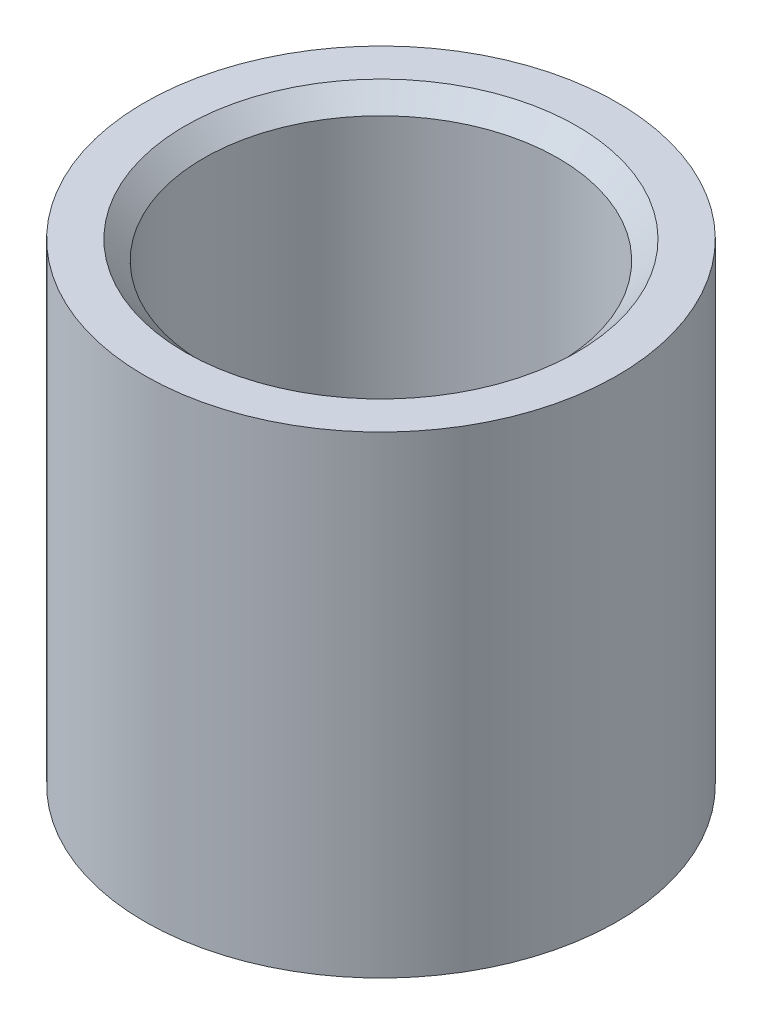
ISO-10303-21;
HEADER;
FILE_DESCRIPTION(('STEP AP214'),'2;1');
FILE_NAME('part.step','',(''),(''),'','','');
FILE_SCHEMA(('AUTOMOTIVE_DESIGN { 1 0 10303 214 1 1 1 1 }'));
ENDSEC;
DATA;
#1=APPLICATION_CONTEXT('core data for automotive mechanical design processes');
#2=APPLICATION_PROTOCOL_DEFINITION('international standard','automotive_design',2000,#1);
#3=PRODUCT_CONTEXT('',#1,'mechanical');
#4=PRODUCT('Part','Part','',(#3));
#5=PRODUCT_RELATED_PRODUCT_CATEGORY('part','',(#4));
#6=PRODUCT_DEFINITION_FORMATION('','',#4);
#7=PRODUCT_DEFINITION_CONTEXT('part definition',#1,'design');
#8=PRODUCT_DEFINITION('design','',#6,#7);
#9=PRODUCT_DEFINITION_SHAPE('','',#8);
#10=(LENGTH_UNIT() NAMED_UNIT(*) SI_UNIT(.MILLI.,.METRE.));
#11=(NAMED_UNIT(*) PLANE_ANGLE_UNIT() SI_UNIT($,.RADIAN.));
#12=(NAMED_UNIT(*) SI_UNIT($,.STERADIAN.) SOLID_ANGLE_UNIT());
#13=UNCERTAINTY_MEASURE_WITH_UNIT(LENGTH_MEASURE(1.E-05),#10,'distance_accuracy_value','');
#14=(GEOMETRIC_REPRESENTATION_CONTEXT(3) GLOBAL_UNCERTAINTY_ASSIGNED_CONTEXT((#13)) GLOBAL_UNIT_ASSIGNED_CONTEXT((#10,
#11,#12)) REPRESENTATION_CONTEXT('',''));
#15=CARTESIAN_POINT('',(0.,0.,0.));
#16=DIRECTION('',(0.,0.,1.));
#17=DIRECTION('',(1.,0.,0.));
#18=AXIS2_PLACEMENT_3D('',#15,#16,#17);
#19=CARTESIAN_POINT('',(0.,6.35,0.));
#20=DIRECTION('',(0.,1.,0.));
#21=DIRECTION('',(0.,0.,1.));
#22=AXIS2_PLACEMENT_3D('',#19,#20,#21);
#23=PLANE('',#22);
#24=CARTESIAN_POINT('',(0.,6.35,0.));
#25=DIRECTION('',(0.,1.,0.));
#26=DIRECTION('',(0.,0.,1.));
#27=AXIS2_PLACEMENT_3D('',#24,#25,#26);
#28=CIRCLE('',#27,2.63125);
#29=CARTESIAN_POINT('',(0.,6.35,2.63125));
#30=VERTEX_POINT('',#29);
#31=EDGE_CURVE('E10',#30,#30,#28,.F.);
#32=ORIENTED_EDGE('',*,*,#31,.T.);
#33=EDGE_LOOP('',(#32));
#34=FACE_BOUND('',#33,.T.);
#35=CARTESIAN_POINT('',(0.,6.35,0.));
#36=DIRECTION('',(0.,1.,0.));
#37=DIRECTION('',(0.,0.,1.));
#38=AXIS2_PLACEMENT_3D('',#35,#36,#37);
#39=CIRCLE('',#38,3.175);
#40=CARTESIAN_POINT('',(0.,6.35,3.175));
#41=VERTEX_POINT('',#40);
#42=EDGE_CURVE('E49',#41,#41,#39,.T.);
#43=ORIENTED_EDGE('',*,*,#42,.T.);
#44=EDGE_LOOP('',(#43));
#45=FACE_BOUND('',#44,.T.);
#46=ADVANCED_FACE('F29',(#34,#45),#23,.T.);
#47=CARTESIAN_POINT('',(0.,0.,0.));
#48=DIRECTION('',(0.,1.,0.));
#49=DIRECTION('',(0.,0.,1.));
#50=AXIS2_PLACEMENT_3D('',#47,#48,#49);
#51=PLANE('',#50);
#52=CARTESIAN_POINT('',(0.,0.,0.));
#53=DIRECTION('',(0.,1.,0.));
#54=DIRECTION('',(0.,0.,1.));
#55=AXIS2_PLACEMENT_3D('',#52,#53,#54);
#56=CIRCLE('',#55,2.63125);
#57=CARTESIAN_POINT('',(0.,0.,2.63125));
#58=VERTEX_POINT('',#57);
#59=EDGE_CURVE('E44',#58,#58,#56,.T.);
#60=ORIENTED_EDGE('',*,*,#59,.T.);
#61=EDGE_LOOP('',(#60));
#62=FACE_BOUND('',#61,.T.);
#63=CARTESIAN_POINT('',(0.,0.,0.));
#64=DIRECTION('',(0.,1.,0.));
#65=DIRECTION('',(0.,0.,1.));
#66=AXIS2_PLACEMENT_3D('',#63,#64,#65);
#67=CIRCLE('',#66,3.175);
#68=CARTESIAN_POINT('',(0.,0.,3.175));
#69=VERTEX_POINT('',#68);
#70=EDGE_CURVE('E50',#69,#69,#67,.T.);
#71=ORIENTED_EDGE('',*,*,#70,.F.);
#72=EDGE_LOOP('',(#71));
#73=FACE_BOUND('',#72,.T.);
#74=ADVANCED_FACE('F61',(#62,#73),#51,.F.);
#75=CARTESIAN_POINT('',(0.,6.35,0.));
#76=DIRECTION('',(0.,-1.,0.));
#77=DIRECTION('',(0.,0.,-1.));
#78=AXIS2_PLACEMENT_3D('',#75,#76,#77);
#79=CYLINDRICAL_SURFACE('',#78,3.175);
#80=ORIENTED_EDGE('',*,*,#42,.F.);
#81=EDGE_LOOP('',(#80));
#82=FACE_BOUND('',#81,.T.);
#83=ORIENTED_EDGE('',*,*,#70,.T.);
#84=EDGE_LOOP('',(#83));
#85=FACE_BOUND('',#84,.T.);
#86=ADVANCED_FACE('F57',(#82,#85),#79,.T.);
#87=CARTESIAN_POINT('',(0.,6.35,0.));
#88=DIRECTION('',(0.,-1.,0.));
#89=DIRECTION('',(0.,0.,-1.));
#90=AXIS2_PLACEMENT_3D('',#87,#88,#89);
#91=CYLINDRICAL_SURFACE('',#90,2.38125);
#92=CARTESIAN_POINT('',(0.,0.25,0.));
#93=DIRECTION('',(0.,1.,0.));
#94=DIRECTION('',(0.,0.,1.));
#95=AXIS2_PLACEMENT_3D('',#92,#93,#94);
#96=CIRCLE('',#95,2.38125);
#97=CARTESIAN_POINT('',(0.,0.25,2.38125));
#98=VERTEX_POINT('',#97);
#99=EDGE_CURVE('E36',#98,#98,#96,.F.);
#100=ORIENTED_EDGE('',*,*,#99,.T.);
#101=EDGE_LOOP('',(#100));
#102=FACE_BOUND('',#101,.T.);
#103=CARTESIAN_POINT('',(0.,6.1,0.));
#104=DIRECTION('',(0.,1.,0.));
#105=DIRECTION('',(0.,0.,1.));
#106=AXIS2_PLACEMENT_3D('',#103,#104,#105);
#107=CIRCLE('',#106,2.38125);
#108=CARTESIAN_POINT('',(0.,6.1,2.38125));
#109=VERTEX_POINT('',#108);
#110=EDGE_CURVE('E40',#109,#109,#107,.T.);
#111=ORIENTED_EDGE('',*,*,#110,.T.);
#112=EDGE_LOOP('',(#111));
#113=FACE_BOUND('',#112,.T.);
#114=ADVANCED_FACE('F60',(#102,#113),#91,.F.);
#115=CARTESIAN_POINT('',(0.,0.,0.));
#116=DIRECTION('',(0.,-1.,0.));
#117=DIRECTION('',(0.,0.,-1.));
#118=AXIS2_PLACEMENT_3D('',#115,#116,#117);
#119=CONICAL_SURFACE('',#118,2.63125,0.785398163397445);
#120=ORIENTED_EDGE('',*,*,#99,.F.);
#121=EDGE_LOOP('',(#120));
#122=FACE_BOUND('',#121,.T.);
#123=ORIENTED_EDGE('',*,*,#59,.F.);
#124=EDGE_LOOP('',(#123));
#125=FACE_BOUND('',#124,.T.);
#126=ADVANCED_FACE('F73',(#122,#125),#119,.F.);
#127=CARTESIAN_POINT('',(0.,6.1,0.));
#128=DIRECTION('',(0.,1.,0.));
#129=DIRECTION('',(0.,0.,1.));
#130=AXIS2_PLACEMENT_3D('',#127,#128,#129);
#131=CONICAL_SURFACE('',#130,2.38125,0.785398163397452);
#132=ORIENTED_EDGE('',*,*,#31,.F.);
#133=EDGE_LOOP('',(#132));
#134=FACE_BOUND('',#133,.T.);
#135=ORIENTED_EDGE('',*,*,#110,.F.);
#136=EDGE_LOOP('',(#135));
#137=FACE_BOUND('',#136,.T.);
#138=ADVANCED_FACE('F31',(#134,#137),#131,.F.);
#139=CLOSED_SHELL('',(#46,#74,#86,#114,#126,#138));
#140=MANIFOLD_SOLID_BREP('B2',#139);
#141=ADVANCED_BREP_SHAPE_REPRESENTATION('',(#18,#140),#14);
#142=SHAPE_DEFINITION_REPRESENTATION(#9,#141);
ENDSEC;
END-ISO-10303-21;
